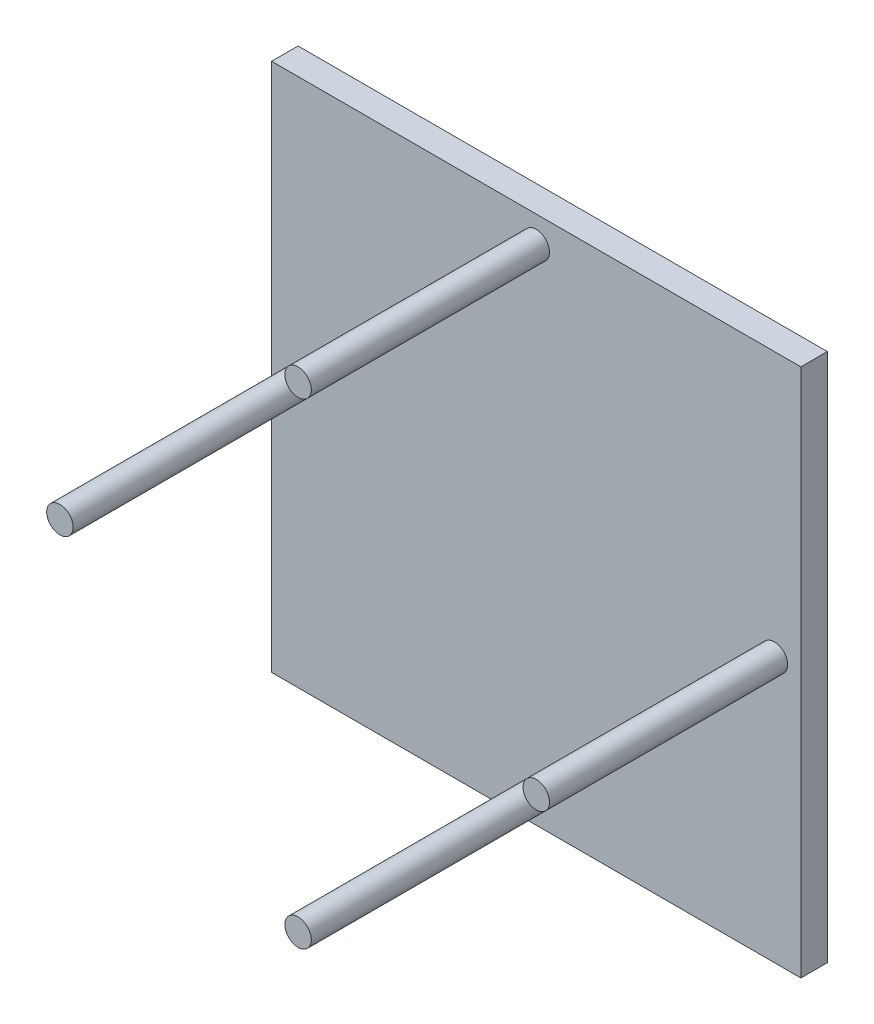
ISO-10303-21;
HEADER;
FILE_DESCRIPTION(('STEP AP214'),'2;1');
FILE_NAME('part.step','',(''),(''),'','','');
FILE_SCHEMA(('AUTOMOTIVE_DESIGN { 1 0 10303 214 1 1 1 1 }'));
ENDSEC;
DATA;
#1=APPLICATION_CONTEXT('core data for automotive mechanical design processes');
#2=APPLICATION_PROTOCOL_DEFINITION('international standard','automotive_design',2000,#1);
#3=PRODUCT_CONTEXT('',#1,'mechanical');
#4=PRODUCT('Part','Part','',(#3));
#5=PRODUCT_RELATED_PRODUCT_CATEGORY('part','',(#4));
#6=PRODUCT_DEFINITION_FORMATION('','',#4);
#7=PRODUCT_DEFINITION_CONTEXT('part definition',#1,'design');
#8=PRODUCT_DEFINITION('design','',#6,#7);
#9=PRODUCT_DEFINITION_SHAPE('','',#8);
#10=(LENGTH_UNIT() NAMED_UNIT(*) SI_UNIT(.MILLI.,.METRE.));
#11=(NAMED_UNIT(*) PLANE_ANGLE_UNIT() SI_UNIT($,.RADIAN.));
#12=(NAMED_UNIT(*) SI_UNIT($,.STERADIAN.) SOLID_ANGLE_UNIT());
#13=UNCERTAINTY_MEASURE_WITH_UNIT(LENGTH_MEASURE(1.E-05),#10,'distance_accuracy_value','');
#14=(GEOMETRIC_REPRESENTATION_CONTEXT(3) GLOBAL_UNCERTAINTY_ASSIGNED_CONTEXT((#13)) GLOBAL_UNIT_ASSIGNED_CONTEXT((#10,
#11,#12)) REPRESENTATION_CONTEXT('',''));
#15=CARTESIAN_POINT('',(0.,0.,0.));
#16=DIRECTION('',(0.,0.,1.));
#17=DIRECTION('',(1.,0.,0.));
#18=AXIS2_PLACEMENT_3D('',#15,#16,#17);
#19=CARTESIAN_POINT('',(0.,0.,10.));
#20=DIRECTION('',(1.,0.,0.));
#21=DIRECTION('',(0.,1.,0.));
#22=AXIS2_PLACEMENT_3D('',#19,#20,#21);
#23=PLANE('',#22);
#24=DIRECTION('',(0.,-1.,0.));
#25=VECTOR('',#24,1.);
#26=CARTESIAN_POINT('',(0.,0.,0.));
#27=LINE('',#26,#25);
#28=CARTESIAN_POINT('',(0.,200.,0.));
#29=VERTEX_POINT('',#28);
#30=CARTESIAN_POINT('',(0.,0.,0.));
#31=VERTEX_POINT('',#30);
#32=EDGE_CURVE('E96',#29,#31,#27,.T.);
#33=ORIENTED_EDGE('',*,*,#32,.T.);
#34=DIRECTION('',(0.,0.,-1.));
#35=VECTOR('',#34,1.);
#36=CARTESIAN_POINT('',(0.,0.,10.));
#37=LINE('',#36,#35);
#38=CARTESIAN_POINT('',(0.,0.,10.));
#39=VERTEX_POINT('',#38);
#40=EDGE_CURVE('E11',#39,#31,#37,.T.);
#41=ORIENTED_EDGE('',*,*,#40,.F.);
#42=DIRECTION('',(0.,-1.,0.));
#43=VECTOR('',#42,1.);
#44=CARTESIAN_POINT('',(0.,0.,10.));
#45=LINE('',#44,#43);
#46=CARTESIAN_POINT('',(0.,200.,10.));
#47=VERTEX_POINT('',#46);
#48=EDGE_CURVE('E84',#47,#39,#45,.T.);
#49=ORIENTED_EDGE('',*,*,#48,.F.);
#50=DIRECTION('',(0.,0.,-1.));
#51=VECTOR('',#50,1.);
#52=CARTESIAN_POINT('',(0.,200.,10.));
#53=LINE('',#52,#51);
#54=EDGE_CURVE('E92',#47,#29,#53,.T.);
#55=ORIENTED_EDGE('',*,*,#54,.T.);
#56=EDGE_LOOP('',(#33,#41,#49,#55));
#57=FACE_BOUND('',#56,.T.);
#58=ADVANCED_FACE('F33',(#57),#23,.F.);
#59=CARTESIAN_POINT('',(0.,0.,10.));
#60=DIRECTION('',(0.,1.,0.));
#61=DIRECTION('',(0.,0.,1.));
#62=AXIS2_PLACEMENT_3D('',#59,#60,#61);
#63=PLANE('',#62);
#64=DIRECTION('',(1.,0.,0.));
#65=VECTOR('',#64,1.);
#66=CARTESIAN_POINT('',(0.,0.,0.));
#67=LINE('',#66,#65);
#68=CARTESIAN_POINT('',(200.,0.,0.));
#69=VERTEX_POINT('',#68);
#70=EDGE_CURVE('E88',#31,#69,#67,.T.);
#71=ORIENTED_EDGE('',*,*,#70,.T.);
#72=DIRECTION('',(0.,0.,-1.));
#73=VECTOR('',#72,1.);
#74=CARTESIAN_POINT('',(200.,0.,10.));
#75=LINE('',#74,#73);
#76=CARTESIAN_POINT('',(200.,0.,10.));
#77=VERTEX_POINT('',#76);
#78=EDGE_CURVE('E41',#77,#69,#75,.T.);
#79=ORIENTED_EDGE('',*,*,#78,.F.);
#80=DIRECTION('',(1.,0.,0.));
#81=VECTOR('',#80,1.);
#82=CARTESIAN_POINT('',(0.,0.,10.));
#83=LINE('',#82,#81);
#84=EDGE_CURVE('E79',#39,#77,#83,.T.);
#85=ORIENTED_EDGE('',*,*,#84,.F.);
#86=ORIENTED_EDGE('',*,*,#40,.T.);
#87=EDGE_LOOP('',(#71,#79,#85,#86));
#88=FACE_BOUND('',#87,.T.);
#89=ADVANCED_FACE('F87',(#88),#63,.F.);
#90=CARTESIAN_POINT('',(200.,0.,10.));
#91=DIRECTION('',(-1.,0.,0.));
#92=DIRECTION('',(0.,-1.,0.));
#93=AXIS2_PLACEMENT_3D('',#90,#91,#92);
#94=PLANE('',#93);
#95=DIRECTION('',(0.,1.,0.));
#96=VECTOR('',#95,1.);
#97=CARTESIAN_POINT('',(200.,0.,0.));
#98=LINE('',#97,#96);
#99=CARTESIAN_POINT('',(200.,200.,0.));
#100=VERTEX_POINT('',#99);
#101=EDGE_CURVE('E66',#69,#100,#98,.T.);
#102=ORIENTED_EDGE('',*,*,#101,.T.);
#103=DIRECTION('',(0.,0.,-1.));
#104=VECTOR('',#103,1.);
#105=CARTESIAN_POINT('',(200.,200.,10.));
#106=LINE('',#105,#104);
#107=CARTESIAN_POINT('',(200.,200.,10.));
#108=VERTEX_POINT('',#107);
#109=EDGE_CURVE('E89',#108,#100,#106,.T.);
#110=ORIENTED_EDGE('',*,*,#109,.F.);
#111=DIRECTION('',(0.,1.,0.));
#112=VECTOR('',#111,1.);
#113=CARTESIAN_POINT('',(200.,0.,10.));
#114=LINE('',#113,#112);
#115=EDGE_CURVE('E82',#77,#108,#114,.T.);
#116=ORIENTED_EDGE('',*,*,#115,.F.);
#117=ORIENTED_EDGE('',*,*,#78,.T.);
#118=EDGE_LOOP('',(#102,#110,#116,#117));
#119=FACE_BOUND('',#118,.T.);
#120=ADVANCED_FACE('F90',(#119),#94,.F.);
#121=CARTESIAN_POINT('',(0.,200.,10.));
#122=DIRECTION('',(0.,-1.,0.));
#123=DIRECTION('',(0.,0.,-1.));
#124=AXIS2_PLACEMENT_3D('',#121,#122,#123);
#125=PLANE('',#124);
#126=DIRECTION('',(-1.,0.,0.));
#127=VECTOR('',#126,1.);
#128=CARTESIAN_POINT('',(0.,200.,0.));
#129=LINE('',#128,#127);
#130=EDGE_CURVE('E72',#100,#29,#129,.T.);
#131=ORIENTED_EDGE('',*,*,#130,.T.);
#132=ORIENTED_EDGE('',*,*,#54,.F.);
#133=DIRECTION('',(-1.,0.,0.));
#134=VECTOR('',#133,1.);
#135=CARTESIAN_POINT('',(0.,200.,10.));
#136=LINE('',#135,#134);
#137=EDGE_CURVE('E49',#108,#47,#136,.T.);
#138=ORIENTED_EDGE('',*,*,#137,.F.);
#139=ORIENTED_EDGE('',*,*,#109,.T.);
#140=EDGE_LOOP('',(#131,#132,#138,#139));
#141=FACE_BOUND('',#140,.T.);
#142=ADVANCED_FACE('F104',(#141),#125,.F.);
#143=CARTESIAN_POINT('',(0.,200.,10.));
#144=DIRECTION('',(0.,0.,-1.));
#145=DIRECTION('',(-1.,0.,0.));
#146=AXIS2_PLACEMENT_3D('',#143,#144,#145);
#147=PLANE('',#146);
#148=CARTESIAN_POINT('',(9.99999999999995,100.,9.99999999999999));
#149=DIRECTION('',(0.,0.,-1.));
#150=DIRECTION('',(-1.,0.,0.));
#151=AXIS2_PLACEMENT_3D('',#148,#149,#150);
#152=CIRCLE('',#151,5.);
#153=CARTESIAN_POINT('',(4.99999999999995,100.,9.99999999999999));
#154=VERTEX_POINT('',#153);
#155=EDGE_CURVE('E127',#154,#154,#152,.T.);
#156=ORIENTED_EDGE('',*,*,#155,.T.);
#157=EDGE_LOOP('',(#156));
#158=FACE_BOUND('',#157,.T.);
#159=CARTESIAN_POINT('',(99.9999999999999,190.,9.99999999999999));
#160=DIRECTION('',(0.,0.,-1.));
#161=DIRECTION('',(-1.,0.,0.));
#162=AXIS2_PLACEMENT_3D('',#159,#160,#161);
#163=CIRCLE('',#162,5.00000000000001);
#164=CARTESIAN_POINT('',(94.9999999999999,190.,9.99999999999999));
#165=VERTEX_POINT('',#164);
#166=EDGE_CURVE('E121',#165,#165,#163,.T.);
#167=ORIENTED_EDGE('',*,*,#166,.T.);
#168=EDGE_LOOP('',(#167));
#169=FACE_BOUND('',#168,.T.);
#170=CARTESIAN_POINT('',(99.9999999999999,10.,9.99999999999999));
#171=DIRECTION('',(0.,0.,-1.));
#172=DIRECTION('',(-1.,0.,0.));
#173=AXIS2_PLACEMENT_3D('',#170,#171,#172);
#174=CIRCLE('',#173,5.);
#175=CARTESIAN_POINT('',(94.9999999999999,10.,9.99999999999999));
#176=VERTEX_POINT('',#175);
#177=EDGE_CURVE('E115',#176,#176,#174,.T.);
#178=ORIENTED_EDGE('',*,*,#177,.T.);
#179=EDGE_LOOP('',(#178));
#180=FACE_BOUND('',#179,.T.);
#181=CARTESIAN_POINT('',(190.,100.,9.99999999999999));
#182=DIRECTION('',(0.,0.,-1.));
#183=DIRECTION('',(-1.,0.,0.));
#184=AXIS2_PLACEMENT_3D('',#181,#182,#183);
#185=CIRCLE('',#184,4.99999999999999);
#186=CARTESIAN_POINT('',(185.,100.,9.99999999999999));
#187=VERTEX_POINT('',#186);
#188=EDGE_CURVE('E99',#187,#187,#185,.T.);
#189=ORIENTED_EDGE('',*,*,#188,.T.);
#190=EDGE_LOOP('',(#189));
#191=FACE_BOUND('',#190,.T.);
#192=ORIENTED_EDGE('',*,*,#48,.T.);
#193=ORIENTED_EDGE('',*,*,#84,.T.);
#194=ORIENTED_EDGE('',*,*,#115,.T.);
#195=ORIENTED_EDGE('',*,*,#137,.T.);
#196=EDGE_LOOP('',(#192,#193,#194,#195));
#197=FACE_BOUND('',#196,.T.);
#198=ADVANCED_FACE('F80',(#158,#169,#180,#191,#197),#147,.F.);
#199=CARTESIAN_POINT('',(0.,200.,0.));
#200=DIRECTION('',(0.,0.,-1.));
#201=DIRECTION('',(-1.,0.,0.));
#202=AXIS2_PLACEMENT_3D('',#199,#200,#201);
#203=PLANE('',#202);
#204=ORIENTED_EDGE('',*,*,#32,.F.);
#205=ORIENTED_EDGE('',*,*,#130,.F.);
#206=ORIENTED_EDGE('',*,*,#101,.F.);
#207=ORIENTED_EDGE('',*,*,#70,.F.);
#208=EDGE_LOOP('',(#204,#205,#206,#207));
#209=FACE_BOUND('',#208,.T.);
#210=ADVANCED_FACE('F107',(#209),#203,.T.);
#211=CARTESIAN_POINT('',(190.,100.,100.));
#212=DIRECTION('',(0.,0.,-1.));
#213=DIRECTION('',(-1.,0.,0.));
#214=AXIS2_PLACEMENT_3D('',#211,#212,#213);
#215=CYLINDRICAL_SURFACE('',#214,4.99999999999999);
#216=CARTESIAN_POINT('',(190.,100.,100.));
#217=DIRECTION('',(0.,0.,-1.));
#218=DIRECTION('',(-1.,0.,0.));
#219=AXIS2_PLACEMENT_3D('',#216,#217,#218);
#220=CIRCLE('',#219,4.99999999999999);
#221=CARTESIAN_POINT('',(185.,100.,100.));
#222=VERTEX_POINT('',#221);
#223=EDGE_CURVE('E112',#222,#222,#220,.T.);
#224=ORIENTED_EDGE('',*,*,#223,.T.);
#225=EDGE_LOOP('',(#224));
#226=FACE_BOUND('',#225,.T.);
#227=ORIENTED_EDGE('',*,*,#188,.F.);
#228=EDGE_LOOP('',(#227));
#229=FACE_BOUND('',#228,.T.);
#230=ADVANCED_FACE('F158',(#226,#229),#215,.T.);
#231=CARTESIAN_POINT('',(190.,100.,100.));
#232=DIRECTION('',(0.,0.,-1.));
#233=DIRECTION('',(-1.,0.,0.));
#234=AXIS2_PLACEMENT_3D('',#231,#232,#233);
#235=PLANE('',#234);
#236=ORIENTED_EDGE('',*,*,#223,.F.);
#237=EDGE_LOOP('',(#236));
#238=FACE_BOUND('',#237,.T.);
#239=ADVANCED_FACE('F164',(#238),#235,.F.);
#240=CARTESIAN_POINT('',(99.9999999999999,10.,100.));
#241=DIRECTION('',(0.,0.,-1.));
#242=DIRECTION('',(-1.,0.,0.));
#243=AXIS2_PLACEMENT_3D('',#240,#241,#242);
#244=CYLINDRICAL_SURFACE('',#243,5.);
#245=CARTESIAN_POINT('',(99.9999999999999,10.,100.));
#246=DIRECTION('',(0.,0.,-1.));
#247=DIRECTION('',(-1.,0.,0.));
#248=AXIS2_PLACEMENT_3D('',#245,#246,#247);
#249=CIRCLE('',#248,5.);
#250=CARTESIAN_POINT('',(94.9999999999999,10.,100.));
#251=VERTEX_POINT('',#250);
#252=EDGE_CURVE('E118',#251,#251,#249,.T.);
#253=ORIENTED_EDGE('',*,*,#252,.T.);
#254=EDGE_LOOP('',(#253));
#255=FACE_BOUND('',#254,.T.);
#256=ORIENTED_EDGE('',*,*,#177,.F.);
#257=EDGE_LOOP('',(#256));
#258=FACE_BOUND('',#257,.T.);
#259=ADVANCED_FACE('F168',(#255,#258),#244,.T.);
#260=CARTESIAN_POINT('',(99.9999999999999,10.,100.));
#261=DIRECTION('',(0.,0.,-1.));
#262=DIRECTION('',(-1.,0.,0.));
#263=AXIS2_PLACEMENT_3D('',#260,#261,#262);
#264=PLANE('',#263);
#265=ORIENTED_EDGE('',*,*,#252,.F.);
#266=EDGE_LOOP('',(#265));
#267=FACE_BOUND('',#266,.T.);
#268=ADVANCED_FACE('F172',(#267),#264,.F.);
#269=CARTESIAN_POINT('',(99.9999999999999,190.,100.));
#270=DIRECTION('',(0.,0.,-1.));
#271=DIRECTION('',(-1.,0.,0.));
#272=AXIS2_PLACEMENT_3D('',#269,#270,#271);
#273=CYLINDRICAL_SURFACE('',#272,5.00000000000001);
#274=CARTESIAN_POINT('',(99.9999999999999,190.,100.));
#275=DIRECTION('',(0.,0.,-1.));
#276=DIRECTION('',(-1.,0.,0.));
#277=AXIS2_PLACEMENT_3D('',#274,#275,#276);
#278=CIRCLE('',#277,5.00000000000001);
#279=CARTESIAN_POINT('',(94.9999999999999,190.,100.));
#280=VERTEX_POINT('',#279);
#281=EDGE_CURVE('E124',#280,#280,#278,.T.);
#282=ORIENTED_EDGE('',*,*,#281,.T.);
#283=EDGE_LOOP('',(#282));
#284=FACE_BOUND('',#283,.T.);
#285=ORIENTED_EDGE('',*,*,#166,.F.);
#286=EDGE_LOOP('',(#285));
#287=FACE_BOUND('',#286,.T.);
#288=ADVANCED_FACE('F176',(#284,#287),#273,.T.);
#289=CARTESIAN_POINT('',(99.9999999999999,190.,100.));
#290=DIRECTION('',(0.,0.,-1.));
#291=DIRECTION('',(-1.,0.,0.));
#292=AXIS2_PLACEMENT_3D('',#289,#290,#291);
#293=PLANE('',#292);
#294=ORIENTED_EDGE('',*,*,#281,.F.);
#295=EDGE_LOOP('',(#294));
#296=FACE_BOUND('',#295,.T.);
#297=ADVANCED_FACE('F143',(#296),#293,.F.);
#298=CARTESIAN_POINT('',(9.99999999999995,100.,100.));
#299=DIRECTION('',(0.,0.,-1.));
#300=DIRECTION('',(-1.,0.,0.));
#301=AXIS2_PLACEMENT_3D('',#298,#299,#300);
#302=CYLINDRICAL_SURFACE('',#301,5.);
#303=CARTESIAN_POINT('',(9.99999999999995,100.,100.));
#304=DIRECTION('',(0.,0.,-1.));
#305=DIRECTION('',(-1.,0.,0.));
#306=AXIS2_PLACEMENT_3D('',#303,#304,#305);
#307=CIRCLE('',#306,5.);
#308=CARTESIAN_POINT('',(4.99999999999995,100.,100.));
#309=VERTEX_POINT('',#308);
#310=EDGE_CURVE('E130',#309,#309,#307,.T.);
#311=ORIENTED_EDGE('',*,*,#310,.T.);
#312=EDGE_LOOP('',(#311));
#313=FACE_BOUND('',#312,.T.);
#314=ORIENTED_EDGE('',*,*,#155,.F.);
#315=EDGE_LOOP('',(#314));
#316=FACE_BOUND('',#315,.T.);
#317=ADVANCED_FACE('F134',(#313,#316),#302,.T.);
#318=CARTESIAN_POINT('',(9.99999999999995,100.,100.));
#319=DIRECTION('',(0.,0.,-1.));
#320=DIRECTION('',(-1.,0.,0.));
#321=AXIS2_PLACEMENT_3D('',#318,#319,#320);
#322=PLANE('',#321);
#323=ORIENTED_EDGE('',*,*,#310,.F.);
#324=EDGE_LOOP('',(#323));
#325=FACE_BOUND('',#324,.T.);
#326=ADVANCED_FACE('F137',(#325),#322,.F.);
#327=CLOSED_SHELL('',(#58,#89,#120,#142,#198,#210,#230,#239,#259,#268,#288,#297,#317,#326));
#328=MANIFOLD_SOLID_BREP('B2',#327);
#329=ADVANCED_BREP_SHAPE_REPRESENTATION('',(#18,#328),#14);
#330=SHAPE_DEFINITION_REPRESENTATION(#9,#329);
ENDSEC;
END-ISO-10303-21;
